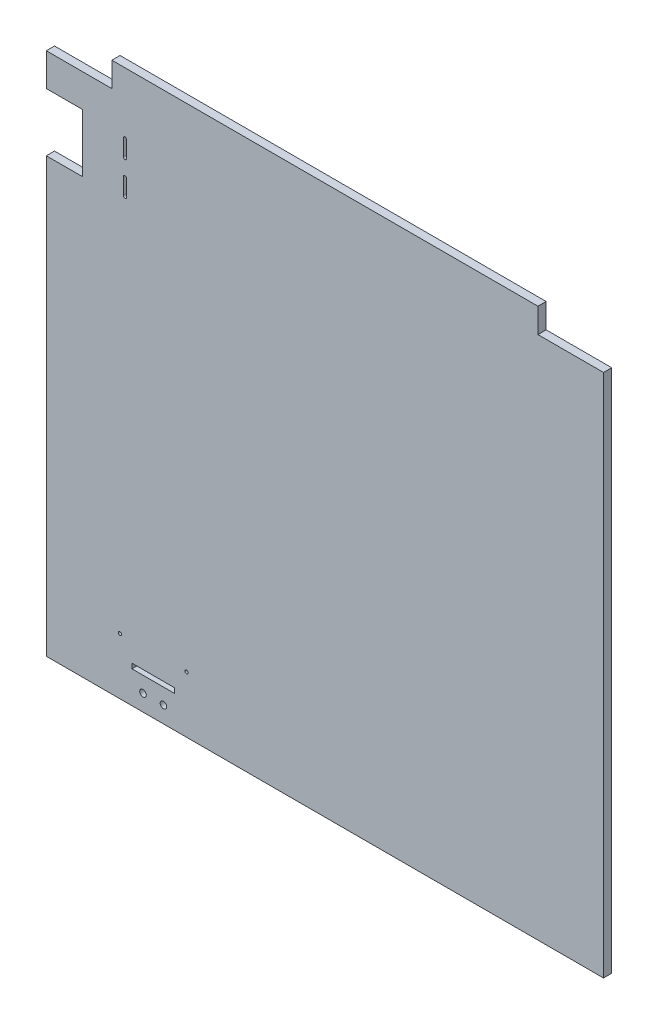
ISO-10303-21;
HEADER;
FILE_DESCRIPTION(('STEP AP214'),'2;1');
FILE_NAME('part.step','',(''),(''),'','','');
FILE_SCHEMA(('AUTOMOTIVE_DESIGN { 1 0 10303 214 1 1 1 1 }'));
ENDSEC;
DATA;
#1=APPLICATION_CONTEXT('core data for automotive mechanical design processes');
#2=APPLICATION_PROTOCOL_DEFINITION('international standard','automotive_design',2000,#1);
#3=PRODUCT_CONTEXT('',#1,'mechanical');
#4=PRODUCT('Part','Part','',(#3));
#5=PRODUCT_RELATED_PRODUCT_CATEGORY('part','',(#4));
#6=PRODUCT_DEFINITION_FORMATION('','',#4);
#7=PRODUCT_DEFINITION_CONTEXT('part definition',#1,'design');
#8=PRODUCT_DEFINITION('design','',#6,#7);
#9=PRODUCT_DEFINITION_SHAPE('','',#8);
#10=(LENGTH_UNIT() NAMED_UNIT(*) SI_UNIT(.MILLI.,.METRE.));
#11=(NAMED_UNIT(*) PLANE_ANGLE_UNIT() SI_UNIT($,.RADIAN.));
#12=(NAMED_UNIT(*) SI_UNIT($,.STERADIAN.) SOLID_ANGLE_UNIT());
#13=UNCERTAINTY_MEASURE_WITH_UNIT(LENGTH_MEASURE(1.E-05),#10,'distance_accuracy_value','');
#14=(GEOMETRIC_REPRESENTATION_CONTEXT(3) GLOBAL_UNCERTAINTY_ASSIGNED_CONTEXT((#13)) GLOBAL_UNIT_ASSIGNED_CONTEXT((#10,
#11,#12)) REPRESENTATION_CONTEXT('',''));
#15=CARTESIAN_POINT('',(0.,0.,0.));
#16=DIRECTION('',(0.,0.,1.));
#17=DIRECTION('',(1.,0.,0.));
#18=AXIS2_PLACEMENT_3D('',#15,#16,#17);
#19=CARTESIAN_POINT('',(-340.,335.,10.));
#20=DIRECTION('',(1.,0.,0.));
#21=DIRECTION('',(0.,1.,0.));
#22=AXIS2_PLACEMENT_3D('',#19,#20,#21);
#23=PLANE('',#22);
#24=DIRECTION('',(0.,-1.,0.));
#25=VECTOR('',#24,1.);
#26=CARTESIAN_POINT('',(-340.,335.,0.));
#27=LINE('',#26,#25);
#28=CARTESIAN_POINT('',(-340.,305.,0.));
#29=VERTEX_POINT('',#28);
#30=CARTESIAN_POINT('',(-340.,265.,0.));
#31=VERTEX_POINT('',#30);
#32=EDGE_CURVE('E393',#29,#31,#27,.T.);
#33=ORIENTED_EDGE('',*,*,#32,.T.);
#34=DIRECTION('',(0.,0.,1.));
#35=VECTOR('',#34,1.);
#36=CARTESIAN_POINT('',(-340.,265.,0.));
#37=LINE('',#36,#35);
#38=CARTESIAN_POINT('',(-340.,265.,10.));
#39=VERTEX_POINT('',#38);
#40=EDGE_CURVE('E280',#31,#39,#37,.T.);
#41=ORIENTED_EDGE('',*,*,#40,.T.);
#42=DIRECTION('',(0.,-1.,0.));
#43=VECTOR('',#42,1.);
#44=CARTESIAN_POINT('',(-340.,335.,10.));
#45=LINE('',#44,#43);
#46=CARTESIAN_POINT('',(-340.,305.,10.));
#47=VERTEX_POINT('',#46);
#48=EDGE_CURVE('E382',#47,#39,#45,.T.);
#49=ORIENTED_EDGE('',*,*,#48,.F.);
#50=DIRECTION('',(0.,0.,1.));
#51=VECTOR('',#50,1.);
#52=CARTESIAN_POINT('',(-340.,305.,0.));
#53=LINE('',#52,#51);
#54=EDGE_CURVE('E370',#29,#47,#53,.T.);
#55=ORIENTED_EDGE('',*,*,#54,.F.);
#56=EDGE_LOOP('',(#33,#41,#49,#55));
#57=FACE_BOUND('',#56,.T.);
#58=ADVANCED_FACE('F33',(#57),#23,.F.);
#59=CARTESIAN_POINT('',(-340.,194.,10.));
#60=VERTEX_POINT('',#59);
#61=CARTESIAN_POINT('',(-340.,-335.,10.));
#62=VERTEX_POINT('',#61);
#63=EDGE_CURVE('E386',#60,#62,#45,.T.);
#64=ORIENTED_EDGE('',*,*,#63,.F.);
#65=DIRECTION('',(0.,0.,1.));
#66=VECTOR('',#65,1.);
#67=CARTESIAN_POINT('',(-340.,194.,0.));
#68=LINE('',#67,#66);
#69=CARTESIAN_POINT('',(-340.,194.,0.));
#70=VERTEX_POINT('',#69);
#71=EDGE_CURVE('E273',#70,#60,#68,.T.);
#72=ORIENTED_EDGE('',*,*,#71,.F.);
#73=CARTESIAN_POINT('',(-340.,-335.,0.));
#74=VERTEX_POINT('',#73);
#75=EDGE_CURVE('E378',#70,#74,#27,.T.);
#76=ORIENTED_EDGE('',*,*,#75,.T.);
#77=DIRECTION('',(0.,0.,-1.));
#78=VECTOR('',#77,1.);
#79=CARTESIAN_POINT('',(-340.,-335.,10.));
#80=LINE('',#79,#78);
#81=EDGE_CURVE('E11',#62,#74,#80,.T.);
#82=ORIENTED_EDGE('',*,*,#81,.F.);
#83=EDGE_LOOP('',(#64,#72,#76,#82));
#84=FACE_BOUND('',#83,.T.);
#85=ADVANCED_FACE('F35',(#84),#23,.F.);
#86=CARTESIAN_POINT('',(-340.,-335.,10.));
#87=DIRECTION('',(0.,1.,0.));
#88=DIRECTION('',(0.,0.,1.));
#89=AXIS2_PLACEMENT_3D('',#86,#87,#88);
#90=PLANE('',#89);
#91=DIRECTION('',(1.,0.,0.));
#92=VECTOR('',#91,1.);
#93=CARTESIAN_POINT('',(-340.,-335.,0.));
#94=LINE('',#93,#92);
#95=CARTESIAN_POINT('',(340.,-335.,0.));
#96=VERTEX_POINT('',#95);
#97=EDGE_CURVE('E396',#74,#96,#94,.T.);
#98=ORIENTED_EDGE('',*,*,#97,.T.);
#99=DIRECTION('',(0.,0.,-1.));
#100=VECTOR('',#99,1.);
#101=CARTESIAN_POINT('',(340.,-335.,10.));
#102=LINE('',#101,#100);
#103=CARTESIAN_POINT('',(340.,-335.,10.));
#104=VERTEX_POINT('',#103);
#105=EDGE_CURVE('E41',#104,#96,#102,.T.);
#106=ORIENTED_EDGE('',*,*,#105,.F.);
#107=DIRECTION('',(1.,0.,0.));
#108=VECTOR('',#107,1.);
#109=CARTESIAN_POINT('',(-340.,-335.,10.));
#110=LINE('',#109,#108);
#111=EDGE_CURVE('E385',#62,#104,#110,.T.);
#112=ORIENTED_EDGE('',*,*,#111,.F.);
#113=ORIENTED_EDGE('',*,*,#81,.T.);
#114=EDGE_LOOP('',(#98,#106,#112,#113));
#115=FACE_BOUND('',#114,.T.);
#116=ADVANCED_FACE('F430',(#115),#90,.F.);
#117=CARTESIAN_POINT('',(340.,335.,10.));
#118=DIRECTION('',(-1.,0.,0.));
#119=DIRECTION('',(0.,-1.,0.));
#120=AXIS2_PLACEMENT_3D('',#117,#118,#119);
#121=PLANE('',#120);
#122=DIRECTION('',(0.,1.,0.));
#123=VECTOR('',#122,1.);
#124=CARTESIAN_POINT('',(340.,335.,0.));
#125=LINE('',#124,#123);
#126=CARTESIAN_POINT('',(340.,305.,0.));
#127=VERTEX_POINT('',#126);
#128=EDGE_CURVE('E398',#96,#127,#125,.T.);
#129=ORIENTED_EDGE('',*,*,#128,.T.);
#130=DIRECTION('',(0.,0.,1.));
#131=VECTOR('',#130,1.);
#132=CARTESIAN_POINT('',(340.,305.,0.));
#133=LINE('',#132,#131);
#134=CARTESIAN_POINT('',(340.,305.,10.));
#135=VERTEX_POINT('',#134);
#136=EDGE_CURVE('E356',#127,#135,#133,.T.);
#137=ORIENTED_EDGE('',*,*,#136,.T.);
#138=DIRECTION('',(0.,1.,0.));
#139=VECTOR('',#138,1.);
#140=CARTESIAN_POINT('',(340.,335.,10.));
#141=LINE('',#140,#139);
#142=EDGE_CURVE('E388',#104,#135,#141,.T.);
#143=ORIENTED_EDGE('',*,*,#142,.F.);
#144=ORIENTED_EDGE('',*,*,#105,.T.);
#145=EDGE_LOOP('',(#129,#137,#143,#144));
#146=FACE_BOUND('',#145,.T.);
#147=ADVANCED_FACE('F407',(#146),#121,.F.);
#148=CARTESIAN_POINT('',(-340.,335.,10.));
#149=DIRECTION('',(0.,-1.,0.));
#150=DIRECTION('',(1.,0.,0.));
#151=AXIS2_PLACEMENT_3D('',#148,#149,#150);
#152=PLANE('',#151);
#153=DIRECTION('',(-1.,0.,0.));
#154=VECTOR('',#153,1.);
#155=CARTESIAN_POINT('',(-340.,335.,10.));
#156=LINE('',#155,#154);
#157=CARTESIAN_POINT('',(260.,335.,10.));
#158=VERTEX_POINT('',#157);
#159=CARTESIAN_POINT('',(-260.,335.,10.));
#160=VERTEX_POINT('',#159);
#161=EDGE_CURVE('E391',#158,#160,#156,.T.);
#162=ORIENTED_EDGE('',*,*,#161,.F.);
#163=DIRECTION('',(0.,0.,1.));
#164=VECTOR('',#163,1.);
#165=CARTESIAN_POINT('',(260.,335.,0.));
#166=LINE('',#165,#164);
#167=CARTESIAN_POINT('',(260.,335.,0.));
#168=VERTEX_POINT('',#167);
#169=EDGE_CURVE('E352',#168,#158,#166,.T.);
#170=ORIENTED_EDGE('',*,*,#169,.F.);
#171=DIRECTION('',(-1.,0.,0.));
#172=VECTOR('',#171,1.);
#173=CARTESIAN_POINT('',(-340.,335.,0.));
#174=LINE('',#173,#172);
#175=CARTESIAN_POINT('',(-260.,335.,0.));
#176=VERTEX_POINT('',#175);
#177=EDGE_CURVE('E401',#168,#176,#174,.T.);
#178=ORIENTED_EDGE('',*,*,#177,.T.);
#179=DIRECTION('',(0.,0.,1.));
#180=VECTOR('',#179,1.);
#181=CARTESIAN_POINT('',(-260.,335.,0.));
#182=LINE('',#181,#180);
#183=EDGE_CURVE('E375',#176,#160,#182,.T.);
#184=ORIENTED_EDGE('',*,*,#183,.T.);
#185=EDGE_LOOP('',(#162,#170,#178,#184));
#186=FACE_BOUND('',#185,.T.);
#187=ADVANCED_FACE('F455',(#186),#152,.F.);
#188=CARTESIAN_POINT('',(0.,0.,10.));
#189=DIRECTION('',(0.,0.,1.));
#190=DIRECTION('',(1.,0.,0.));
#191=AXIS2_PLACEMENT_3D('',#188,#189,#190);
#192=PLANE('',#191);
#193=CARTESIAN_POINT('',(-244.,219.,10.));
#194=DIRECTION('',(0.,0.,1.));
#195=DIRECTION('',(1.,0.,0.));
#196=AXIS2_PLACEMENT_3D('',#193,#194,#195);
#197=CIRCLE('',#196,2.);
#198=CARTESIAN_POINT('',(-242.,219.,10.));
#199=VERTEX_POINT('',#198);
#200=CARTESIAN_POINT('',(-246.,219.,10.));
#201=VERTEX_POINT('',#200);
#202=EDGE_CURVE('E48',#199,#201,#197,.T.);
#203=ORIENTED_EDGE('',*,*,#202,.F.);
#204=DIRECTION('',(0.,1.,0.));
#205=VECTOR('',#204,1.);
#206=CARTESIAN_POINT('',(-242.,219.,10.));
#207=LINE('',#206,#205);
#208=CARTESIAN_POINT('',(-242.,199.,10.));
#209=VERTEX_POINT('',#208);
#210=EDGE_CURVE('E212',#209,#199,#207,.T.);
#211=ORIENTED_EDGE('',*,*,#210,.F.);
#212=CARTESIAN_POINT('',(-244.,199.,10.));
#213=DIRECTION('',(0.,0.,1.));
#214=DIRECTION('',(1.,0.,0.));
#215=AXIS2_PLACEMENT_3D('',#212,#213,#214);
#216=CIRCLE('',#215,1.99999999999999);
#217=CARTESIAN_POINT('',(-246.,199.,10.));
#218=VERTEX_POINT('',#217);
#219=EDGE_CURVE('E215',#218,#209,#216,.T.);
#220=ORIENTED_EDGE('',*,*,#219,.F.);
#221=DIRECTION('',(0.,-1.,0.));
#222=VECTOR('',#221,1.);
#223=CARTESIAN_POINT('',(-246.,219.,10.));
#224=LINE('',#223,#222);
#225=EDGE_CURVE('E221',#201,#218,#224,.T.);
#226=ORIENTED_EDGE('',*,*,#225,.F.);
#227=EDGE_LOOP('',(#203,#211,#220,#226));
#228=FACE_BOUND('',#227,.T.);
#229=CARTESIAN_POINT('',(-244.,260.,10.));
#230=DIRECTION('',(0.,0.,1.));
#231=DIRECTION('',(1.,0.,0.));
#232=AXIS2_PLACEMENT_3D('',#229,#230,#231);
#233=CIRCLE('',#232,2.00000000000002);
#234=CARTESIAN_POINT('',(-242.,260.,10.));
#235=VERTEX_POINT('',#234);
#236=CARTESIAN_POINT('',(-246.,260.,10.));
#237=VERTEX_POINT('',#236);
#238=EDGE_CURVE('E227',#235,#237,#233,.T.);
#239=ORIENTED_EDGE('',*,*,#238,.F.);
#240=DIRECTION('',(0.,1.,0.));
#241=VECTOR('',#240,1.);
#242=CARTESIAN_POINT('',(-242.,260.,10.));
#243=LINE('',#242,#241);
#244=CARTESIAN_POINT('',(-242.,240.,10.));
#245=VERTEX_POINT('',#244);
#246=EDGE_CURVE('E235',#245,#235,#243,.T.);
#247=ORIENTED_EDGE('',*,*,#246,.F.);
#248=CARTESIAN_POINT('',(-244.,240.,10.));
#249=DIRECTION('',(0.,0.,1.));
#250=DIRECTION('',(1.,0.,0.));
#251=AXIS2_PLACEMENT_3D('',#248,#249,#250);
#252=CIRCLE('',#251,2.);
#253=CARTESIAN_POINT('',(-246.,240.,10.));
#254=VERTEX_POINT('',#253);
#255=EDGE_CURVE('E249',#254,#245,#252,.T.);
#256=ORIENTED_EDGE('',*,*,#255,.F.);
#257=DIRECTION('',(0.,-1.,0.));
#258=VECTOR('',#257,1.);
#259=CARTESIAN_POINT('',(-246.,260.,10.));
#260=LINE('',#259,#258);
#261=EDGE_CURVE('E246',#237,#254,#260,.T.);
#262=ORIENTED_EDGE('',*,*,#261,.F.);
#263=EDGE_LOOP('',(#239,#247,#256,#262));
#264=FACE_BOUND('',#263,.T.);
#265=DIRECTION('',(-1.,0.,0.));
#266=VECTOR('',#265,1.);
#267=CARTESIAN_POINT('',(-340.,265.,10.));
#268=LINE('',#267,#266);
#269=CARTESIAN_POINT('',(-296.,265.,10.));
#270=VERTEX_POINT('',#269);
#271=EDGE_CURVE('E267',#270,#39,#268,.T.);
#272=ORIENTED_EDGE('',*,*,#271,.F.);
#273=DIRECTION('',(0.,1.,0.));
#274=VECTOR('',#273,1.);
#275=CARTESIAN_POINT('',(-296.,265.,10.));
#276=LINE('',#275,#274);
#277=CARTESIAN_POINT('',(-296.,194.,10.));
#278=VERTEX_POINT('',#277);
#279=EDGE_CURVE('E276',#278,#270,#276,.T.);
#280=ORIENTED_EDGE('',*,*,#279,.F.);
#281=DIRECTION('',(1.,0.,0.));
#282=VECTOR('',#281,1.);
#283=CARTESIAN_POINT('',(-340.,194.,10.));
#284=LINE('',#283,#282);
#285=EDGE_CURVE('E256',#60,#278,#284,.T.);
#286=ORIENTED_EDGE('',*,*,#285,.F.);
#287=ORIENTED_EDGE('',*,*,#63,.T.);
#288=ORIENTED_EDGE('',*,*,#111,.T.);
#289=ORIENTED_EDGE('',*,*,#142,.T.);
#290=DIRECTION('',(1.,0.,0.));
#291=VECTOR('',#290,1.);
#292=CARTESIAN_POINT('',(340.,305.,10.));
#293=LINE('',#292,#291);
#294=CARTESIAN_POINT('',(260.,305.,10.));
#295=VERTEX_POINT('',#294);
#296=EDGE_CURVE('E349',#295,#135,#293,.T.);
#297=ORIENTED_EDGE('',*,*,#296,.F.);
#298=DIRECTION('',(0.,-1.,0.));
#299=VECTOR('',#298,1.);
#300=CARTESIAN_POINT('',(260.,335.,10.));
#301=LINE('',#300,#299);
#302=EDGE_CURVE('E338',#158,#295,#301,.T.);
#303=ORIENTED_EDGE('',*,*,#302,.F.);
#304=ORIENTED_EDGE('',*,*,#161,.T.);
#305=DIRECTION('',(0.,1.,0.));
#306=VECTOR('',#305,1.);
#307=CARTESIAN_POINT('',(-260.,335.,10.));
#308=LINE('',#307,#306);
#309=CARTESIAN_POINT('',(-260.,305.,10.));
#310=VERTEX_POINT('',#309);
#311=EDGE_CURVE('E367',#310,#160,#308,.T.);
#312=ORIENTED_EDGE('',*,*,#311,.F.);
#313=DIRECTION('',(1.,0.,0.));
#314=VECTOR('',#313,1.);
#315=CARTESIAN_POINT('',(-340.,305.,10.));
#316=LINE('',#315,#314);
#317=EDGE_CURVE('E359',#47,#310,#316,.T.);
#318=ORIENTED_EDGE('',*,*,#317,.F.);
#319=ORIENTED_EDGE('',*,*,#48,.T.);
#320=EDGE_LOOP('',(#272,#280,#286,#287,#288,#289,#297,#303,#304,#312,#318,#319));
#321=FACE_BOUND('',#320,.T.);
#322=CARTESIAN_POINT('',(-169.,-266.,10.));
#323=DIRECTION('',(0.,0.,1.));
#324=DIRECTION('',(1.,0.,0.));
#325=AXIS2_PLACEMENT_3D('',#322,#323,#324);
#326=CIRCLE('',#325,2.);
#327=CARTESIAN_POINT('',(-167.,-266.,10.));
#328=VERTEX_POINT('',#327);
#329=EDGE_CURVE('E283',#328,#328,#326,.T.);
#330=ORIENTED_EDGE('',*,*,#329,.F.);
#331=EDGE_LOOP('',(#330));
#332=FACE_BOUND('',#331,.T.);
#333=CARTESIAN_POINT('',(-250.,-266.,10.));
#334=DIRECTION('',(0.,0.,1.));
#335=DIRECTION('',(1.,0.,0.));
#336=AXIS2_PLACEMENT_3D('',#333,#334,#335);
#337=CIRCLE('',#336,2.);
#338=CARTESIAN_POINT('',(-248.,-266.,10.));
#339=VERTEX_POINT('',#338);
#340=EDGE_CURVE('E292',#339,#339,#337,.T.);
#341=ORIENTED_EDGE('',*,*,#340,.F.);
#342=EDGE_LOOP('',(#341));
#343=FACE_BOUND('',#342,.T.);
#344=CARTESIAN_POINT('',(-197.,-315.,10.));
#345=DIRECTION('',(0.,0.,1.));
#346=DIRECTION('',(1.,0.,0.));
#347=AXIS2_PLACEMENT_3D('',#344,#345,#346);
#348=CIRCLE('',#347,3.99999999999999);
#349=CARTESIAN_POINT('',(-193.,-315.,10.));
#350=VERTEX_POINT('',#349);
#351=EDGE_CURVE('E298',#350,#350,#348,.T.);
#352=ORIENTED_EDGE('',*,*,#351,.F.);
#353=EDGE_LOOP('',(#352));
#354=FACE_BOUND('',#353,.T.);
#355=CARTESIAN_POINT('',(-222.,-315.,10.));
#356=DIRECTION('',(0.,0.,1.));
#357=DIRECTION('',(1.,0.,0.));
#358=AXIS2_PLACEMENT_3D('',#355,#356,#357);
#359=CIRCLE('',#358,3.99999999999999);
#360=CARTESIAN_POINT('',(-218.,-315.,10.));
#361=VERTEX_POINT('',#360);
#362=EDGE_CURVE('E304',#361,#361,#359,.T.);
#363=ORIENTED_EDGE('',*,*,#362,.F.);
#364=EDGE_LOOP('',(#363));
#365=FACE_BOUND('',#364,.T.);
#366=DIRECTION('',(0.,-1.,0.));
#367=VECTOR('',#366,1.);
#368=CARTESIAN_POINT('',(-235.5,-290.,10.));
#369=LINE('',#368,#367);
#370=CARTESIAN_POINT('',(-235.5,-290.,10.));
#371=VERTEX_POINT('',#370);
#372=CARTESIAN_POINT('',(-235.5,-296.,10.));
#373=VERTEX_POINT('',#372);
#374=EDGE_CURVE('E310',#371,#373,#369,.T.);
#375=ORIENTED_EDGE('',*,*,#374,.F.);
#376=DIRECTION('',(-1.,0.,0.));
#377=VECTOR('',#376,1.);
#378=CARTESIAN_POINT('',(-235.5,-290.,10.));
#379=LINE('',#378,#377);
#380=CARTESIAN_POINT('',(-183.5,-290.,10.));
#381=VERTEX_POINT('',#380);
#382=EDGE_CURVE('E317',#381,#371,#379,.T.);
#383=ORIENTED_EDGE('',*,*,#382,.F.);
#384=DIRECTION('',(0.,1.,0.));
#385=VECTOR('',#384,1.);
#386=CARTESIAN_POINT('',(-183.5,-290.,10.));
#387=LINE('',#386,#385);
#388=CARTESIAN_POINT('',(-183.5,-296.,10.));
#389=VERTEX_POINT('',#388);
#390=EDGE_CURVE('E331',#389,#381,#387,.T.);
#391=ORIENTED_EDGE('',*,*,#390,.F.);
#392=DIRECTION('',(1.,0.,0.));
#393=VECTOR('',#392,1.);
#394=CARTESIAN_POINT('',(-235.5,-296.,10.));
#395=LINE('',#394,#393);
#396=EDGE_CURVE('E328',#373,#389,#395,.T.);
#397=ORIENTED_EDGE('',*,*,#396,.F.);
#398=EDGE_LOOP('',(#375,#383,#391,#397));
#399=FACE_BOUND('',#398,.T.);
#400=ADVANCED_FACE('F425',(#228,#264,#321,#332,#343,#354,#365,#399),#192,.T.);
#401=CARTESIAN_POINT('',(0.,0.,0.));
#402=DIRECTION('',(0.,0.,1.));
#403=DIRECTION('',(1.,0.,0.));
#404=AXIS2_PLACEMENT_3D('',#401,#402,#403);
#405=PLANE('',#404);
#406=DIRECTION('',(0.,1.,0.));
#407=VECTOR('',#406,1.);
#408=CARTESIAN_POINT('',(-242.,219.,0.));
#409=LINE('',#408,#407);
#410=CARTESIAN_POINT('',(-242.,199.,0.));
#411=VERTEX_POINT('',#410);
#412=CARTESIAN_POINT('',(-242.,219.,0.));
#413=VERTEX_POINT('',#412);
#414=EDGE_CURVE('E202',#411,#413,#409,.T.);
#415=ORIENTED_EDGE('',*,*,#414,.T.);
#416=CARTESIAN_POINT('',(-244.,219.,0.));
#417=DIRECTION('',(0.,0.,1.));
#418=DIRECTION('',(1.,0.,0.));
#419=AXIS2_PLACEMENT_3D('',#416,#417,#418);
#420=CIRCLE('',#419,2.);
#421=CARTESIAN_POINT('',(-246.,219.,0.));
#422=VERTEX_POINT('',#421);
#423=EDGE_CURVE('E196',#413,#422,#420,.T.);
#424=ORIENTED_EDGE('',*,*,#423,.T.);
#425=DIRECTION('',(0.,-1.,0.));
#426=VECTOR('',#425,1.);
#427=CARTESIAN_POINT('',(-246.,219.,0.));
#428=LINE('',#427,#426);
#429=CARTESIAN_POINT('',(-246.,199.,0.));
#430=VERTEX_POINT('',#429);
#431=EDGE_CURVE('E205',#422,#430,#428,.T.);
#432=ORIENTED_EDGE('',*,*,#431,.T.);
#433=CARTESIAN_POINT('',(-244.,199.,0.));
#434=DIRECTION('',(0.,0.,1.));
#435=DIRECTION('',(1.,0.,0.));
#436=AXIS2_PLACEMENT_3D('',#433,#434,#435);
#437=CIRCLE('',#436,1.99999999999999);
#438=EDGE_CURVE('E56',#430,#411,#437,.T.);
#439=ORIENTED_EDGE('',*,*,#438,.T.);
#440=EDGE_LOOP('',(#415,#424,#432,#439));
#441=FACE_BOUND('',#440,.T.);
#442=DIRECTION('',(0.,1.,0.));
#443=VECTOR('',#442,1.);
#444=CARTESIAN_POINT('',(-242.,260.,0.));
#445=LINE('',#444,#443);
#446=CARTESIAN_POINT('',(-242.,240.,0.));
#447=VERTEX_POINT('',#446);
#448=CARTESIAN_POINT('',(-242.,260.,0.));
#449=VERTEX_POINT('',#448);
#450=EDGE_CURVE('E241',#447,#449,#445,.T.);
#451=ORIENTED_EDGE('',*,*,#450,.T.);
#452=CARTESIAN_POINT('',(-244.,260.,0.));
#453=DIRECTION('',(0.,0.,1.));
#454=DIRECTION('',(1.,0.,0.));
#455=AXIS2_PLACEMENT_3D('',#452,#453,#454);
#456=CIRCLE('',#455,2.00000000000002);
#457=CARTESIAN_POINT('',(-246.,260.,0.));
#458=VERTEX_POINT('',#457);
#459=EDGE_CURVE('E231',#449,#458,#456,.T.);
#460=ORIENTED_EDGE('',*,*,#459,.T.);
#461=DIRECTION('',(0.,-1.,0.));
#462=VECTOR('',#461,1.);
#463=CARTESIAN_POINT('',(-246.,260.,0.));
#464=LINE('',#463,#462);
#465=CARTESIAN_POINT('',(-246.,240.,0.));
#466=VERTEX_POINT('',#465);
#467=EDGE_CURVE('E234',#458,#466,#464,.T.);
#468=ORIENTED_EDGE('',*,*,#467,.T.);
#469=CARTESIAN_POINT('',(-244.,240.,0.));
#470=DIRECTION('',(0.,0.,1.));
#471=DIRECTION('',(1.,0.,0.));
#472=AXIS2_PLACEMENT_3D('',#469,#470,#471);
#473=CIRCLE('',#472,2.);
#474=EDGE_CURVE('E238',#466,#447,#473,.T.);
#475=ORIENTED_EDGE('',*,*,#474,.T.);
#476=EDGE_LOOP('',(#451,#460,#468,#475));
#477=FACE_BOUND('',#476,.T.);
#478=CARTESIAN_POINT('',(-169.,-266.,0.));
#479=DIRECTION('',(0.,0.,1.));
#480=DIRECTION('',(1.,0.,0.));
#481=AXIS2_PLACEMENT_3D('',#478,#479,#480);
#482=CIRCLE('',#481,2.);
#483=CARTESIAN_POINT('',(-167.,-266.,0.));
#484=VERTEX_POINT('',#483);
#485=EDGE_CURVE('E289',#484,#484,#482,.T.);
#486=ORIENTED_EDGE('',*,*,#485,.T.);
#487=EDGE_LOOP('',(#486));
#488=FACE_BOUND('',#487,.T.);
#489=CARTESIAN_POINT('',(-250.,-266.,0.));
#490=DIRECTION('',(0.,0.,1.));
#491=DIRECTION('',(1.,0.,0.));
#492=AXIS2_PLACEMENT_3D('',#489,#490,#491);
#493=CIRCLE('',#492,2.);
#494=CARTESIAN_POINT('',(-248.,-266.,0.));
#495=VERTEX_POINT('',#494);
#496=EDGE_CURVE('E295',#495,#495,#493,.T.);
#497=ORIENTED_EDGE('',*,*,#496,.T.);
#498=EDGE_LOOP('',(#497));
#499=FACE_BOUND('',#498,.T.);
#500=CARTESIAN_POINT('',(-197.,-315.,0.));
#501=DIRECTION('',(0.,0.,1.));
#502=DIRECTION('',(1.,0.,0.));
#503=AXIS2_PLACEMENT_3D('',#500,#501,#502);
#504=CIRCLE('',#503,3.99999999999999);
#505=CARTESIAN_POINT('',(-193.,-315.,0.));
#506=VERTEX_POINT('',#505);
#507=EDGE_CURVE('E301',#506,#506,#504,.T.);
#508=ORIENTED_EDGE('',*,*,#507,.T.);
#509=EDGE_LOOP('',(#508));
#510=FACE_BOUND('',#509,.T.);
#511=CARTESIAN_POINT('',(-222.,-315.,0.));
#512=DIRECTION('',(0.,0.,1.));
#513=DIRECTION('',(1.,0.,0.));
#514=AXIS2_PLACEMENT_3D('',#511,#512,#513);
#515=CIRCLE('',#514,3.99999999999999);
#516=CARTESIAN_POINT('',(-218.,-315.,0.));
#517=VERTEX_POINT('',#516);
#518=EDGE_CURVE('E307',#517,#517,#515,.T.);
#519=ORIENTED_EDGE('',*,*,#518,.T.);
#520=EDGE_LOOP('',(#519));
#521=FACE_BOUND('',#520,.T.);
#522=DIRECTION('',(-1.,0.,0.));
#523=VECTOR('',#522,1.);
#524=CARTESIAN_POINT('',(-235.5,-290.,0.));
#525=LINE('',#524,#523);
#526=CARTESIAN_POINT('',(-183.5,-290.,0.));
#527=VERTEX_POINT('',#526);
#528=CARTESIAN_POINT('',(-235.5,-290.,0.));
#529=VERTEX_POINT('',#528);
#530=EDGE_CURVE('E323',#527,#529,#525,.T.);
#531=ORIENTED_EDGE('',*,*,#530,.T.);
#532=DIRECTION('',(0.,-1.,0.));
#533=VECTOR('',#532,1.);
#534=CARTESIAN_POINT('',(-235.5,-290.,0.));
#535=LINE('',#534,#533);
#536=CARTESIAN_POINT('',(-235.5,-296.,0.));
#537=VERTEX_POINT('',#536);
#538=EDGE_CURVE('E313',#529,#537,#535,.T.);
#539=ORIENTED_EDGE('',*,*,#538,.T.);
#540=DIRECTION('',(1.,0.,0.));
#541=VECTOR('',#540,1.);
#542=CARTESIAN_POINT('',(-235.5,-296.,0.));
#543=LINE('',#542,#541);
#544=CARTESIAN_POINT('',(-183.5,-296.,0.));
#545=VERTEX_POINT('',#544);
#546=EDGE_CURVE('E316',#537,#545,#543,.T.);
#547=ORIENTED_EDGE('',*,*,#546,.T.);
#548=DIRECTION('',(0.,1.,0.));
#549=VECTOR('',#548,1.);
#550=CARTESIAN_POINT('',(-183.5,-290.,0.));
#551=LINE('',#550,#549);
#552=EDGE_CURVE('E320',#545,#527,#551,.T.);
#553=ORIENTED_EDGE('',*,*,#552,.T.);
#554=EDGE_LOOP('',(#531,#539,#547,#553));
#555=FACE_BOUND('',#554,.T.);
#556=DIRECTION('',(0.,1.,0.));
#557=VECTOR('',#556,1.);
#558=CARTESIAN_POINT('',(-296.,265.,0.));
#559=LINE('',#558,#557);
#560=CARTESIAN_POINT('',(-296.,194.,0.));
#561=VERTEX_POINT('',#560);
#562=CARTESIAN_POINT('',(-296.,265.,0.));
#563=VERTEX_POINT('',#562);
#564=EDGE_CURVE('E266',#561,#563,#559,.T.);
#565=ORIENTED_EDGE('',*,*,#564,.T.);
#566=DIRECTION('',(-1.,0.,0.));
#567=VECTOR('',#566,1.);
#568=CARTESIAN_POINT('',(-340.,265.,0.));
#569=LINE('',#568,#567);
#570=EDGE_CURVE('E270',#563,#31,#569,.T.);
#571=ORIENTED_EDGE('',*,*,#570,.T.);
#572=ORIENTED_EDGE('',*,*,#32,.F.);
#573=DIRECTION('',(1.,0.,0.));
#574=VECTOR('',#573,1.);
#575=CARTESIAN_POINT('',(-340.,305.,0.));
#576=LINE('',#575,#574);
#577=CARTESIAN_POINT('',(-260.,305.,0.));
#578=VERTEX_POINT('',#577);
#579=EDGE_CURVE('E363',#29,#578,#576,.T.);
#580=ORIENTED_EDGE('',*,*,#579,.T.);
#581=DIRECTION('',(0.,1.,0.));
#582=VECTOR('',#581,1.);
#583=CARTESIAN_POINT('',(-260.,335.,0.));
#584=LINE('',#583,#582);
#585=EDGE_CURVE('E366',#578,#176,#584,.T.);
#586=ORIENTED_EDGE('',*,*,#585,.T.);
#587=ORIENTED_EDGE('',*,*,#177,.F.);
#588=DIRECTION('',(0.,-1.,0.));
#589=VECTOR('',#588,1.);
#590=CARTESIAN_POINT('',(260.,335.,0.));
#591=LINE('',#590,#589);
#592=CARTESIAN_POINT('',(260.,305.,0.));
#593=VERTEX_POINT('',#592);
#594=EDGE_CURVE('E345',#168,#593,#591,.T.);
#595=ORIENTED_EDGE('',*,*,#594,.T.);
#596=DIRECTION('',(1.,0.,0.));
#597=VECTOR('',#596,1.);
#598=CARTESIAN_POINT('',(340.,305.,0.));
#599=LINE('',#598,#597);
#600=EDGE_CURVE('E348',#593,#127,#599,.T.);
#601=ORIENTED_EDGE('',*,*,#600,.T.);
#602=ORIENTED_EDGE('',*,*,#128,.F.);
#603=ORIENTED_EDGE('',*,*,#97,.F.);
#604=ORIENTED_EDGE('',*,*,#75,.F.);
#605=DIRECTION('',(1.,0.,0.));
#606=VECTOR('',#605,1.);
#607=CARTESIAN_POINT('',(-340.,194.,0.));
#608=LINE('',#607,#606);
#609=EDGE_CURVE('E263',#70,#561,#608,.T.);
#610=ORIENTED_EDGE('',*,*,#609,.T.);
#611=EDGE_LOOP('',(#565,#571,#572,#580,#586,#587,#595,#601,#602,#603,#604,#610));
#612=FACE_BOUND('',#611,.T.);
#613=ADVANCED_FACE('F209',(#441,#477,#488,#499,#510,#521,#555,#612),#405,.F.);
#614=CARTESIAN_POINT('',(-260.,335.,0.));
#615=DIRECTION('',(1.,0.,0.));
#616=DIRECTION('',(0.,0.,-1.));
#617=AXIS2_PLACEMENT_3D('',#614,#615,#616);
#618=PLANE('',#617);
#619=ORIENTED_EDGE('',*,*,#311,.T.);
#620=ORIENTED_EDGE('',*,*,#183,.F.);
#621=ORIENTED_EDGE('',*,*,#585,.F.);
#622=DIRECTION('',(0.,0.,1.));
#623=VECTOR('',#622,1.);
#624=CARTESIAN_POINT('',(-260.,305.,0.));
#625=LINE('',#624,#623);
#626=EDGE_CURVE('E379',#578,#310,#625,.T.);
#627=ORIENTED_EDGE('',*,*,#626,.T.);
#628=EDGE_LOOP('',(#619,#620,#621,#627));
#629=FACE_BOUND('',#628,.T.);
#630=ADVANCED_FACE('F453',(#629),#618,.F.);
#631=CARTESIAN_POINT('',(-340.,305.,0.));
#632=DIRECTION('',(0.,-1.,0.));
#633=DIRECTION('',(0.,0.,-1.));
#634=AXIS2_PLACEMENT_3D('',#631,#632,#633);
#635=PLANE('',#634);
#636=ORIENTED_EDGE('',*,*,#317,.T.);
#637=ORIENTED_EDGE('',*,*,#626,.F.);
#638=ORIENTED_EDGE('',*,*,#579,.F.);
#639=ORIENTED_EDGE('',*,*,#54,.T.);
#640=EDGE_LOOP('',(#636,#637,#638,#639));
#641=FACE_BOUND('',#640,.T.);
#642=ADVANCED_FACE('F448',(#641),#635,.F.);
#643=CARTESIAN_POINT('',(340.,305.,0.));
#644=DIRECTION('',(0.,-1.,0.));
#645=DIRECTION('',(0.,0.,-1.));
#646=AXIS2_PLACEMENT_3D('',#643,#644,#645);
#647=PLANE('',#646);
#648=ORIENTED_EDGE('',*,*,#296,.T.);
#649=ORIENTED_EDGE('',*,*,#136,.F.);
#650=ORIENTED_EDGE('',*,*,#600,.F.);
#651=DIRECTION('',(0.,0.,1.));
#652=VECTOR('',#651,1.);
#653=CARTESIAN_POINT('',(260.,305.,0.));
#654=LINE('',#653,#652);
#655=EDGE_CURVE('E360',#593,#295,#654,.T.);
#656=ORIENTED_EDGE('',*,*,#655,.T.);
#657=EDGE_LOOP('',(#648,#649,#650,#656));
#658=FACE_BOUND('',#657,.T.);
#659=ADVANCED_FACE('F416',(#658),#647,.F.);
#660=CARTESIAN_POINT('',(260.,335.,0.));
#661=DIRECTION('',(-1.,0.,0.));
#662=DIRECTION('',(0.,-1.,0.));
#663=AXIS2_PLACEMENT_3D('',#660,#661,#662);
#664=PLANE('',#663);
#665=ORIENTED_EDGE('',*,*,#302,.T.);
#666=ORIENTED_EDGE('',*,*,#655,.F.);
#667=ORIENTED_EDGE('',*,*,#594,.F.);
#668=ORIENTED_EDGE('',*,*,#169,.T.);
#669=EDGE_LOOP('',(#665,#666,#667,#668));
#670=FACE_BOUND('',#669,.T.);
#671=ADVANCED_FACE('F418',(#670),#664,.F.);
#672=CARTESIAN_POINT('',(-235.5,-290.,0.));
#673=DIRECTION('',(-1.,0.,0.));
#674=DIRECTION('',(0.,-1.,0.));
#675=AXIS2_PLACEMENT_3D('',#672,#673,#674);
#676=PLANE('',#675);
#677=ORIENTED_EDGE('',*,*,#374,.T.);
#678=DIRECTION('',(0.,0.,1.));
#679=VECTOR('',#678,1.);
#680=CARTESIAN_POINT('',(-235.5,-296.,0.));
#681=LINE('',#680,#679);
#682=EDGE_CURVE('E326',#537,#373,#681,.T.);
#683=ORIENTED_EDGE('',*,*,#682,.F.);
#684=ORIENTED_EDGE('',*,*,#538,.F.);
#685=DIRECTION('',(0.,0.,1.));
#686=VECTOR('',#685,1.);
#687=CARTESIAN_POINT('',(-235.5,-290.,0.));
#688=LINE('',#687,#686);
#689=EDGE_CURVE('E336',#529,#371,#688,.T.);
#690=ORIENTED_EDGE('',*,*,#689,.T.);
#691=EDGE_LOOP('',(#677,#683,#684,#690));
#692=FACE_BOUND('',#691,.T.);
#693=ADVANCED_FACE('F528',(#692),#676,.F.);
#694=CARTESIAN_POINT('',(-235.5,-290.,0.));
#695=DIRECTION('',(0.,1.,0.));
#696=DIRECTION('',(-1.,0.,0.));
#697=AXIS2_PLACEMENT_3D('',#694,#695,#696);
#698=PLANE('',#697);
#699=ORIENTED_EDGE('',*,*,#382,.T.);
#700=ORIENTED_EDGE('',*,*,#689,.F.);
#701=ORIENTED_EDGE('',*,*,#530,.F.);
#702=DIRECTION('',(0.,0.,1.));
#703=VECTOR('',#702,1.);
#704=CARTESIAN_POINT('',(-183.5,-290.,0.));
#705=LINE('',#704,#703);
#706=EDGE_CURVE('E339',#527,#381,#705,.T.);
#707=ORIENTED_EDGE('',*,*,#706,.T.);
#708=EDGE_LOOP('',(#699,#700,#701,#707));
#709=FACE_BOUND('',#708,.T.);
#710=ADVANCED_FACE('F535',(#709),#698,.F.);
#711=CARTESIAN_POINT('',(-183.5,-290.,0.));
#712=DIRECTION('',(1.,0.,0.));
#713=DIRECTION('',(0.,0.,-1.));
#714=AXIS2_PLACEMENT_3D('',#711,#712,#713);
#715=PLANE('',#714);
#716=ORIENTED_EDGE('',*,*,#390,.T.);
#717=ORIENTED_EDGE('',*,*,#706,.F.);
#718=ORIENTED_EDGE('',*,*,#552,.F.);
#719=DIRECTION('',(0.,0.,1.));
#720=VECTOR('',#719,1.);
#721=CARTESIAN_POINT('',(-183.5,-296.,0.));
#722=LINE('',#721,#720);
#723=EDGE_CURVE('E341',#545,#389,#722,.T.);
#724=ORIENTED_EDGE('',*,*,#723,.T.);
#725=EDGE_LOOP('',(#716,#717,#718,#724));
#726=FACE_BOUND('',#725,.T.);
#727=ADVANCED_FACE('F543',(#726),#715,.F.);
#728=CARTESIAN_POINT('',(-235.5,-296.,0.));
#729=DIRECTION('',(0.,-1.,0.));
#730=DIRECTION('',(0.,0.,-1.));
#731=AXIS2_PLACEMENT_3D('',#728,#729,#730);
#732=PLANE('',#731);
#733=ORIENTED_EDGE('',*,*,#396,.T.);
#734=ORIENTED_EDGE('',*,*,#723,.F.);
#735=ORIENTED_EDGE('',*,*,#546,.F.);
#736=ORIENTED_EDGE('',*,*,#682,.T.);
#737=EDGE_LOOP('',(#733,#734,#735,#736));
#738=FACE_BOUND('',#737,.T.);
#739=ADVANCED_FACE('F551',(#738),#732,.F.);
#740=CARTESIAN_POINT('',(-222.,-315.,0.));
#741=DIRECTION('',(0.,0.,1.));
#742=DIRECTION('',(1.,0.,0.));
#743=AXIS2_PLACEMENT_3D('',#740,#741,#742);
#744=CYLINDRICAL_SURFACE('',#743,3.99999999999999);
#745=ORIENTED_EDGE('',*,*,#518,.F.);
#746=EDGE_LOOP('',(#745));
#747=FACE_BOUND('',#746,.T.);
#748=ORIENTED_EDGE('',*,*,#362,.T.);
#749=EDGE_LOOP('',(#748));
#750=FACE_BOUND('',#749,.T.);
#751=ADVANCED_FACE('F559',(#747,#750),#744,.F.);
#752=CARTESIAN_POINT('',(-197.,-315.,0.));
#753=DIRECTION('',(0.,0.,1.));
#754=DIRECTION('',(1.,0.,0.));
#755=AXIS2_PLACEMENT_3D('',#752,#753,#754);
#756=CYLINDRICAL_SURFACE('',#755,3.99999999999999);
#757=ORIENTED_EDGE('',*,*,#507,.F.);
#758=EDGE_LOOP('',(#757));
#759=FACE_BOUND('',#758,.T.);
#760=ORIENTED_EDGE('',*,*,#351,.T.);
#761=EDGE_LOOP('',(#760));
#762=FACE_BOUND('',#761,.T.);
#763=ADVANCED_FACE('F567',(#759,#762),#756,.F.);
#764=CARTESIAN_POINT('',(-250.,-266.,0.));
#765=DIRECTION('',(0.,0.,1.));
#766=DIRECTION('',(1.,0.,0.));
#767=AXIS2_PLACEMENT_3D('',#764,#765,#766);
#768=CYLINDRICAL_SURFACE('',#767,2.);
#769=ORIENTED_EDGE('',*,*,#496,.F.);
#770=EDGE_LOOP('',(#769));
#771=FACE_BOUND('',#770,.T.);
#772=ORIENTED_EDGE('',*,*,#340,.T.);
#773=EDGE_LOOP('',(#772));
#774=FACE_BOUND('',#773,.T.);
#775=ADVANCED_FACE('F575',(#771,#774),#768,.F.);
#776=CARTESIAN_POINT('',(-169.,-266.,0.));
#777=DIRECTION('',(0.,0.,1.));
#778=DIRECTION('',(1.,0.,0.));
#779=AXIS2_PLACEMENT_3D('',#776,#777,#778);
#780=CYLINDRICAL_SURFACE('',#779,2.);
#781=ORIENTED_EDGE('',*,*,#485,.F.);
#782=EDGE_LOOP('',(#781));
#783=FACE_BOUND('',#782,.T.);
#784=ORIENTED_EDGE('',*,*,#329,.T.);
#785=EDGE_LOOP('',(#784));
#786=FACE_BOUND('',#785,.T.);
#787=ADVANCED_FACE('F583',(#783,#786),#780,.F.);
#788=CARTESIAN_POINT('',(-340.,265.,0.));
#789=DIRECTION('',(0.,1.,0.));
#790=DIRECTION('',(0.,0.,1.));
#791=AXIS2_PLACEMENT_3D('',#788,#789,#790);
#792=PLANE('',#791);
#793=ORIENTED_EDGE('',*,*,#271,.T.);
#794=ORIENTED_EDGE('',*,*,#40,.F.);
#795=ORIENTED_EDGE('',*,*,#570,.F.);
#796=DIRECTION('',(0.,0.,1.));
#797=VECTOR('',#796,1.);
#798=CARTESIAN_POINT('',(-296.,265.,0.));
#799=LINE('',#798,#797);
#800=EDGE_CURVE('E284',#563,#270,#799,.T.);
#801=ORIENTED_EDGE('',*,*,#800,.T.);
#802=EDGE_LOOP('',(#793,#794,#795,#801));
#803=FACE_BOUND('',#802,.T.);
#804=ADVANCED_FACE('F441',(#803),#792,.F.);
#805=CARTESIAN_POINT('',(-296.,265.,0.));
#806=DIRECTION('',(1.,0.,0.));
#807=DIRECTION('',(0.,1.,0.));
#808=AXIS2_PLACEMENT_3D('',#805,#806,#807);
#809=PLANE('',#808);
#810=ORIENTED_EDGE('',*,*,#279,.T.);
#811=ORIENTED_EDGE('',*,*,#800,.F.);
#812=ORIENTED_EDGE('',*,*,#564,.F.);
#813=DIRECTION('',(0.,0.,1.));
#814=VECTOR('',#813,1.);
#815=CARTESIAN_POINT('',(-296.,194.,0.));
#816=LINE('',#815,#814);
#817=EDGE_CURVE('E286',#561,#278,#816,.T.);
#818=ORIENTED_EDGE('',*,*,#817,.T.);
#819=EDGE_LOOP('',(#810,#811,#812,#818));
#820=FACE_BOUND('',#819,.T.);
#821=ADVANCED_FACE('F438',(#820),#809,.F.);
#822=CARTESIAN_POINT('',(-340.,194.,0.));
#823=DIRECTION('',(0.,-1.,0.));
#824=DIRECTION('',(0.,0.,-1.));
#825=AXIS2_PLACEMENT_3D('',#822,#823,#824);
#826=PLANE('',#825);
#827=ORIENTED_EDGE('',*,*,#285,.T.);
#828=ORIENTED_EDGE('',*,*,#817,.F.);
#829=ORIENTED_EDGE('',*,*,#609,.F.);
#830=ORIENTED_EDGE('',*,*,#71,.T.);
#831=EDGE_LOOP('',(#827,#828,#829,#830));
#832=FACE_BOUND('',#831,.T.);
#833=ADVANCED_FACE('F435',(#832),#826,.F.);
#834=CARTESIAN_POINT('',(-244.,260.,0.));
#835=DIRECTION('',(0.,0.,1.));
#836=DIRECTION('',(1.,0.,0.));
#837=AXIS2_PLACEMENT_3D('',#834,#835,#836);
#838=CYLINDRICAL_SURFACE('',#837,2.00000000000002);
#839=ORIENTED_EDGE('',*,*,#238,.T.);
#840=DIRECTION('',(0.,0.,1.));
#841=VECTOR('',#840,1.);
#842=CARTESIAN_POINT('',(-246.,260.,0.));
#843=LINE('',#842,#841);
#844=EDGE_CURVE('E244',#458,#237,#843,.T.);
#845=ORIENTED_EDGE('',*,*,#844,.F.);
#846=ORIENTED_EDGE('',*,*,#459,.F.);
#847=DIRECTION('',(0.,0.,1.));
#848=VECTOR('',#847,1.);
#849=CARTESIAN_POINT('',(-242.,260.,0.));
#850=LINE('',#849,#848);
#851=EDGE_CURVE('E254',#449,#235,#850,.T.);
#852=ORIENTED_EDGE('',*,*,#851,.T.);
#853=EDGE_LOOP('',(#839,#845,#846,#852));
#854=FACE_BOUND('',#853,.T.);
#855=ADVANCED_FACE('F611',(#854),#838,.F.);
#856=CARTESIAN_POINT('',(-242.,260.,0.));
#857=DIRECTION('',(1.,0.,0.));
#858=DIRECTION('',(0.,1.,0.));
#859=AXIS2_PLACEMENT_3D('',#856,#857,#858);
#860=PLANE('',#859);
#861=ORIENTED_EDGE('',*,*,#246,.T.);
#862=ORIENTED_EDGE('',*,*,#851,.F.);
#863=ORIENTED_EDGE('',*,*,#450,.F.);
#864=DIRECTION('',(0.,0.,1.));
#865=VECTOR('',#864,1.);
#866=CARTESIAN_POINT('',(-242.,240.,0.));
#867=LINE('',#866,#865);
#868=EDGE_CURVE('E257',#447,#245,#867,.T.);
#869=ORIENTED_EDGE('',*,*,#868,.T.);
#870=EDGE_LOOP('',(#861,#862,#863,#869));
#871=FACE_BOUND('',#870,.T.);
#872=ADVANCED_FACE('F617',(#871),#860,.F.);
#873=CARTESIAN_POINT('',(-244.,240.,0.));
#874=DIRECTION('',(0.,0.,1.));
#875=DIRECTION('',(1.,0.,0.));
#876=AXIS2_PLACEMENT_3D('',#873,#874,#875);
#877=CYLINDRICAL_SURFACE('',#876,2.);
#878=ORIENTED_EDGE('',*,*,#255,.T.);
#879=ORIENTED_EDGE('',*,*,#868,.F.);
#880=ORIENTED_EDGE('',*,*,#474,.F.);
#881=DIRECTION('',(0.,0.,1.));
#882=VECTOR('',#881,1.);
#883=CARTESIAN_POINT('',(-246.,240.,0.));
#884=LINE('',#883,#882);
#885=EDGE_CURVE('E259',#466,#254,#884,.T.);
#886=ORIENTED_EDGE('',*,*,#885,.T.);
#887=EDGE_LOOP('',(#878,#879,#880,#886));
#888=FACE_BOUND('',#887,.T.);
#889=ADVANCED_FACE('F625',(#888),#877,.F.);
#890=CARTESIAN_POINT('',(-246.,260.,0.));
#891=DIRECTION('',(-1.,0.,0.));
#892=DIRECTION('',(0.,-1.,0.));
#893=AXIS2_PLACEMENT_3D('',#890,#891,#892);
#894=PLANE('',#893);
#895=ORIENTED_EDGE('',*,*,#261,.T.);
#896=ORIENTED_EDGE('',*,*,#885,.F.);
#897=ORIENTED_EDGE('',*,*,#467,.F.);
#898=ORIENTED_EDGE('',*,*,#844,.T.);
#899=EDGE_LOOP('',(#895,#896,#897,#898));
#900=FACE_BOUND('',#899,.T.);
#901=ADVANCED_FACE('F633',(#900),#894,.F.);
#902=CARTESIAN_POINT('',(-244.,219.,0.));
#903=DIRECTION('',(0.,0.,1.));
#904=DIRECTION('',(1.,0.,0.));
#905=AXIS2_PLACEMENT_3D('',#902,#903,#904);
#906=CYLINDRICAL_SURFACE('',#905,2.);
#907=ORIENTED_EDGE('',*,*,#202,.T.);
#908=DIRECTION('',(0.,0.,1.));
#909=VECTOR('',#908,1.);
#910=CARTESIAN_POINT('',(-246.,219.,0.));
#911=LINE('',#910,#909);
#912=EDGE_CURVE('E192',#422,#201,#911,.T.);
#913=ORIENTED_EDGE('',*,*,#912,.F.);
#914=ORIENTED_EDGE('',*,*,#423,.F.);
#915=DIRECTION('',(0.,0.,1.));
#916=VECTOR('',#915,1.);
#917=CARTESIAN_POINT('',(-242.,219.,0.));
#918=LINE('',#917,#916);
#919=EDGE_CURVE('E225',#413,#199,#918,.T.);
#920=ORIENTED_EDGE('',*,*,#919,.T.);
#921=EDGE_LOOP('',(#907,#913,#914,#920));
#922=FACE_BOUND('',#921,.T.);
#923=ADVANCED_FACE('F194',(#922),#906,.F.);
#924=CARTESIAN_POINT('',(-242.,219.,0.));
#925=DIRECTION('',(1.,0.,0.));
#926=DIRECTION('',(0.,1.,0.));
#927=AXIS2_PLACEMENT_3D('',#924,#925,#926);
#928=PLANE('',#927);
#929=ORIENTED_EDGE('',*,*,#210,.T.);
#930=ORIENTED_EDGE('',*,*,#919,.F.);
#931=ORIENTED_EDGE('',*,*,#414,.F.);
#932=DIRECTION('',(0.,0.,1.));
#933=VECTOR('',#932,1.);
#934=CARTESIAN_POINT('',(-242.,199.,0.));
#935=LINE('',#934,#933);
#936=EDGE_CURVE('E228',#411,#209,#935,.T.);
#937=ORIENTED_EDGE('',*,*,#936,.T.);
#938=EDGE_LOOP('',(#929,#930,#931,#937));
#939=FACE_BOUND('',#938,.T.);
#940=ADVANCED_FACE('F648',(#939),#928,.F.);
#941=CARTESIAN_POINT('',(-244.,199.,0.));
#942=DIRECTION('',(0.,0.,1.));
#943=DIRECTION('',(1.,0.,0.));
#944=AXIS2_PLACEMENT_3D('',#941,#942,#943);
#945=CYLINDRICAL_SURFACE('',#944,1.99999999999999);
#946=ORIENTED_EDGE('',*,*,#219,.T.);
#947=ORIENTED_EDGE('',*,*,#936,.F.);
#948=ORIENTED_EDGE('',*,*,#438,.F.);
#949=DIRECTION('',(0.,0.,1.));
#950=VECTOR('',#949,1.);
#951=CARTESIAN_POINT('',(-246.,199.,0.));
#952=LINE('',#951,#950);
#953=EDGE_CURVE('E201',#430,#218,#952,.T.);
#954=ORIENTED_EDGE('',*,*,#953,.T.);
#955=EDGE_LOOP('',(#946,#947,#948,#954));
#956=FACE_BOUND('',#955,.T.);
#957=ADVANCED_FACE('F655',(#956),#945,.F.);
#958=CARTESIAN_POINT('',(-246.,219.,0.));
#959=DIRECTION('',(-1.,0.,0.));
#960=DIRECTION('',(0.,-1.,0.));
#961=AXIS2_PLACEMENT_3D('',#958,#959,#960);
#962=PLANE('',#961);
#963=ORIENTED_EDGE('',*,*,#225,.T.);
#964=ORIENTED_EDGE('',*,*,#953,.F.);
#965=ORIENTED_EDGE('',*,*,#431,.F.);
#966=ORIENTED_EDGE('',*,*,#912,.T.);
#967=EDGE_LOOP('',(#963,#964,#965,#966));
#968=FACE_BOUND('',#967,.T.);
#969=ADVANCED_FACE('F206',(#968),#962,.F.);
#970=CLOSED_SHELL('',(#58,#85,#116,#147,#187,#400,#613,#630,#642,#659,#671,#693,#710,#727,#739,
#751,#763,#775,#787,#804,#821,#833,#855,#872,#889,#901,#923,#940,#957,#969));
#971=MANIFOLD_SOLID_BREP('B2',#970);
#972=ADVANCED_BREP_SHAPE_REPRESENTATION('',(#18,#971),#14);
#973=SHAPE_DEFINITION_REPRESENTATION(#9,#972);
ENDSEC;
END-ISO-10303-21;
